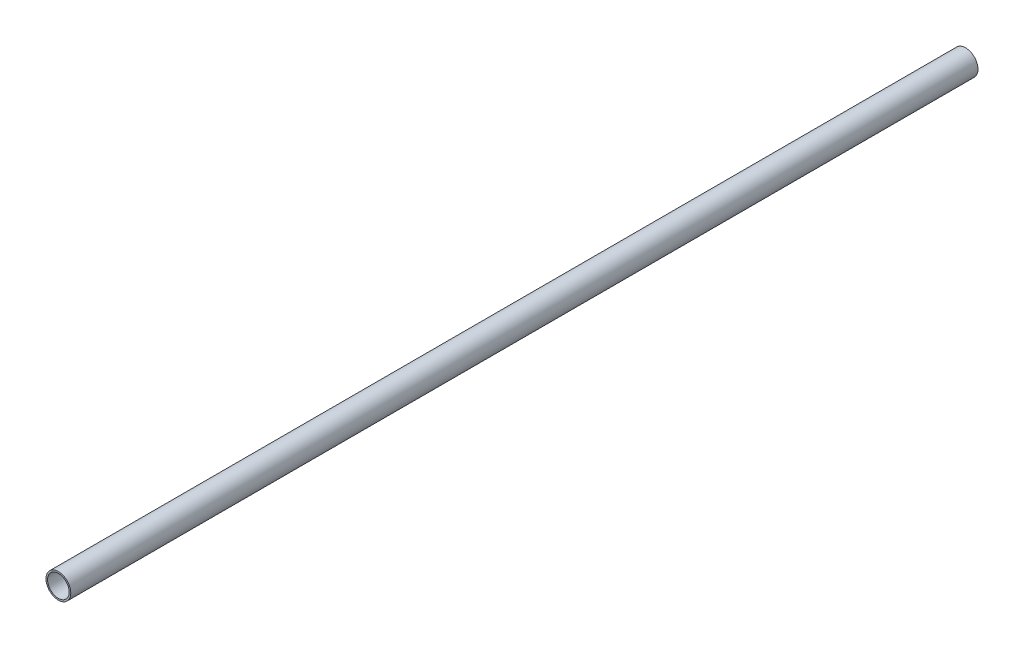
ISO-10303-21;
HEADER;
FILE_DESCRIPTION(('STEP AP214'),'2;1');
FILE_NAME('part.step','',(''),(''),'','','');
FILE_SCHEMA(('AUTOMOTIVE_DESIGN { 1 0 10303 214 1 1 1 1 }'));
ENDSEC;
DATA;
#1=APPLICATION_CONTEXT('core data for automotive mechanical design processes');
#2=APPLICATION_PROTOCOL_DEFINITION('international standard','automotive_design',2000,#1);
#3=PRODUCT_CONTEXT('',#1,'mechanical');
#4=PRODUCT('Part','Part','',(#3));
#5=PRODUCT_RELATED_PRODUCT_CATEGORY('part','',(#4));
#6=PRODUCT_DEFINITION_FORMATION('','',#4);
#7=PRODUCT_DEFINITION_CONTEXT('part definition',#1,'design');
#8=PRODUCT_DEFINITION('design','',#6,#7);
#9=PRODUCT_DEFINITION_SHAPE('','',#8);
#10=(LENGTH_UNIT() NAMED_UNIT(*) SI_UNIT(.MILLI.,.METRE.));
#11=(NAMED_UNIT(*) PLANE_ANGLE_UNIT() SI_UNIT($,.RADIAN.));
#12=(NAMED_UNIT(*) SI_UNIT($,.STERADIAN.) SOLID_ANGLE_UNIT());
#13=UNCERTAINTY_MEASURE_WITH_UNIT(LENGTH_MEASURE(1.E-05),#10,'distance_accuracy_value','');
#14=(GEOMETRIC_REPRESENTATION_CONTEXT(3) GLOBAL_UNCERTAINTY_ASSIGNED_CONTEXT((#13)) GLOBAL_UNIT_ASSIGNED_CONTEXT((#10,
#11,#12)) REPRESENTATION_CONTEXT('',''));
#15=CARTESIAN_POINT('',(0.,0.,0.));
#16=DIRECTION('',(0.,0.,1.));
#17=DIRECTION('',(1.,0.,0.));
#18=AXIS2_PLACEMENT_3D('',#15,#16,#17);
#19=CARTESIAN_POINT('',(-425.,40.45,283.5));
#20=DIRECTION('',(0.,0.,-1.));
#21=DIRECTION('',(-1.,0.,0.));
#22=AXIS2_PLACEMENT_3D('',#19,#20,#21);
#23=CYLINDRICAL_SURFACE('',#22,7.74999999999997);
#24=CARTESIAN_POINT('',(-425.,40.45,283.5));
#25=DIRECTION('',(0.,0.,1.));
#26=DIRECTION('',(1.,0.,0.));
#27=AXIS2_PLACEMENT_3D('',#24,#25,#26);
#28=CIRCLE('',#27,7.74999999999997);
#29=CARTESIAN_POINT('',(-417.25,40.45,283.5));
#30=VERTEX_POINT('',#29);
#31=EDGE_CURVE('E10',#30,#30,#28,.T.);
#32=ORIENTED_EDGE('',*,*,#31,.F.);
#33=EDGE_LOOP('',(#32));
#34=FACE_BOUND('',#33,.T.);
#35=CARTESIAN_POINT('',(-425.,40.45,-283.5));
#36=DIRECTION('',(0.,0.,1.));
#37=DIRECTION('',(1.,0.,0.));
#38=AXIS2_PLACEMENT_3D('',#35,#36,#37);
#39=CIRCLE('',#38,7.74999999999997);
#40=CARTESIAN_POINT('',(-417.25,40.45,-283.5));
#41=VERTEX_POINT('',#40);
#42=EDGE_CURVE('E38',#41,#41,#39,.T.);
#43=ORIENTED_EDGE('',*,*,#42,.T.);
#44=EDGE_LOOP('',(#43));
#45=FACE_BOUND('',#44,.T.);
#46=ADVANCED_FACE('F31',(#34,#45),#23,.T.);
#47=CARTESIAN_POINT('',(-425.,40.45,283.5));
#48=DIRECTION('',(0.,0.,1.));
#49=DIRECTION('',(1.,0.,0.));
#50=AXIS2_PLACEMENT_3D('',#47,#48,#49);
#51=PLANE('',#50);
#52=CARTESIAN_POINT('',(-425.,40.45,283.5));
#53=DIRECTION('',(0.,0.,1.));
#54=DIRECTION('',(1.,0.,0.));
#55=AXIS2_PLACEMENT_3D('',#52,#53,#54);
#56=CIRCLE('',#55,6.74999999999998);
#57=CARTESIAN_POINT('',(-418.25,40.45,283.5));
#58=VERTEX_POINT('',#57);
#59=EDGE_CURVE('E43',#58,#58,#56,.T.);
#60=ORIENTED_EDGE('',*,*,#59,.F.);
#61=EDGE_LOOP('',(#60));
#62=FACE_BOUND('',#61,.T.);
#63=ORIENTED_EDGE('',*,*,#31,.T.);
#64=EDGE_LOOP('',(#63));
#65=FACE_BOUND('',#64,.T.);
#66=ADVANCED_FACE('F60',(#62,#65),#51,.T.);
#67=CARTESIAN_POINT('',(-425.,40.45,-283.5));
#68=DIRECTION('',(0.,0.,1.));
#69=DIRECTION('',(1.,0.,0.));
#70=AXIS2_PLACEMENT_3D('',#67,#68,#69);
#71=PLANE('',#70);
#72=CARTESIAN_POINT('',(-425.,40.45,-283.5));
#73=DIRECTION('',(0.,0.,1.));
#74=DIRECTION('',(1.,0.,0.));
#75=AXIS2_PLACEMENT_3D('',#72,#73,#74);
#76=CIRCLE('',#75,6.74999999999998);
#77=CARTESIAN_POINT('',(-418.25,40.45,-283.5));
#78=VERTEX_POINT('',#77);
#79=EDGE_CURVE('E34',#78,#78,#76,.T.);
#80=ORIENTED_EDGE('',*,*,#79,.T.);
#81=EDGE_LOOP('',(#80));
#82=FACE_BOUND('',#81,.T.);
#83=ORIENTED_EDGE('',*,*,#42,.F.);
#84=EDGE_LOOP('',(#83));
#85=FACE_BOUND('',#84,.T.);
#86=ADVANCED_FACE('F51',(#82,#85),#71,.F.);
#87=CARTESIAN_POINT('',(-425.,40.45,-284.7));
#88=DIRECTION('',(0.,0.,1.));
#89=DIRECTION('',(1.,0.,0.));
#90=AXIS2_PLACEMENT_3D('',#87,#88,#89);
#91=CYLINDRICAL_SURFACE('',#90,6.74999999999998);
#92=ORIENTED_EDGE('',*,*,#59,.T.);
#93=EDGE_LOOP('',(#92));
#94=FACE_BOUND('',#93,.T.);
#95=ORIENTED_EDGE('',*,*,#79,.F.);
#96=EDGE_LOOP('',(#95));
#97=FACE_BOUND('',#96,.T.);
#98=ADVANCED_FACE('F54',(#94,#97),#91,.F.);
#99=CLOSED_SHELL('',(#46,#66,#86,#98));
#100=MANIFOLD_SOLID_BREP('B2',#99);
#101=ADVANCED_BREP_SHAPE_REPRESENTATION('',(#18,#100),#14);
#102=SHAPE_DEFINITION_REPRESENTATION(#9,#101);
ENDSEC;
END-ISO-10303-21;
